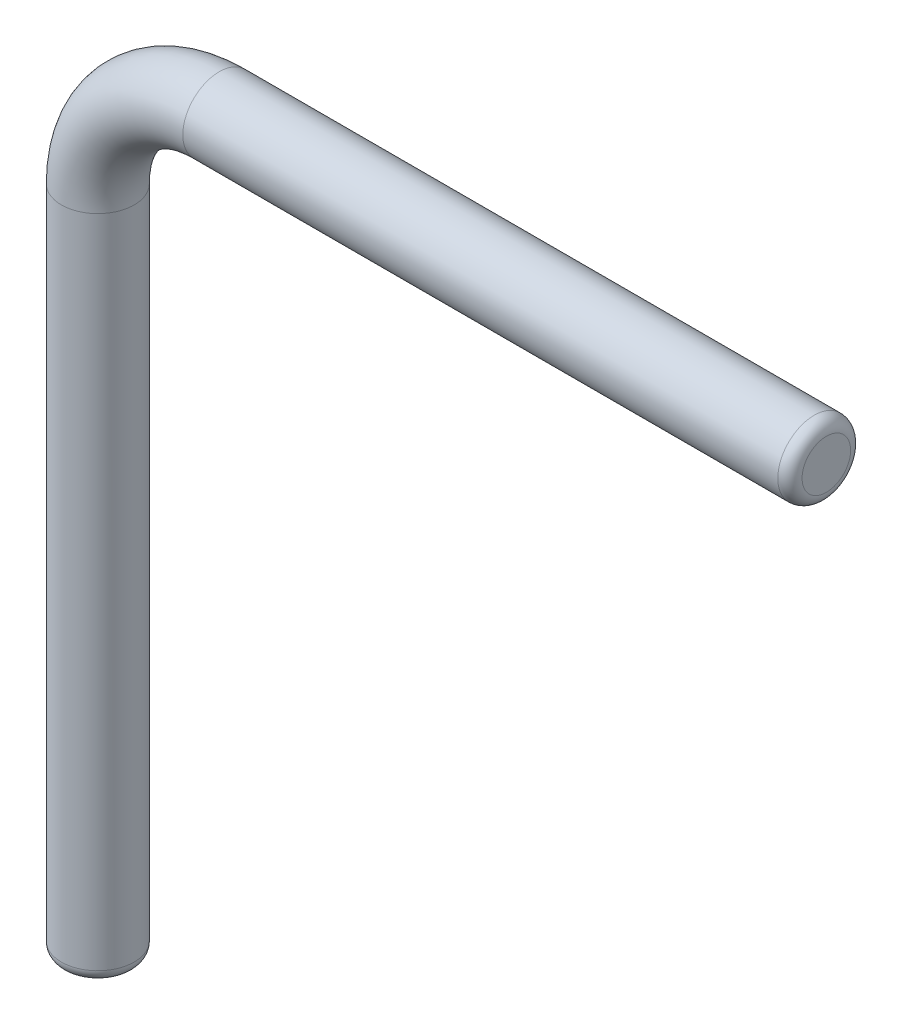
ISO-10303-21;
HEADER;
FILE_DESCRIPTION(('STEP AP214'),'2;1');
FILE_NAME('part.step','',(''),(''),'','','');
FILE_SCHEMA(('AUTOMOTIVE_DESIGN { 1 0 10303 214 1 1 1 1 }'));
ENDSEC;
DATA;
#1=APPLICATION_CONTEXT('core data for automotive mechanical design processes');
#2=APPLICATION_PROTOCOL_DEFINITION('international standard','automotive_design',2000,#1);
#3=PRODUCT_CONTEXT('',#1,'mechanical');
#4=PRODUCT('Part','Part','',(#3));
#5=PRODUCT_RELATED_PRODUCT_CATEGORY('part','',(#4));
#6=PRODUCT_DEFINITION_FORMATION('','',#4);
#7=PRODUCT_DEFINITION_CONTEXT('part definition',#1,'design');
#8=PRODUCT_DEFINITION('design','',#6,#7);
#9=PRODUCT_DEFINITION_SHAPE('','',#8);
#10=(LENGTH_UNIT() NAMED_UNIT(*) SI_UNIT(.MILLI.,.METRE.));
#11=(NAMED_UNIT(*) PLANE_ANGLE_UNIT() SI_UNIT($,.RADIAN.));
#12=(NAMED_UNIT(*) SI_UNIT($,.STERADIAN.) SOLID_ANGLE_UNIT());
#13=UNCERTAINTY_MEASURE_WITH_UNIT(LENGTH_MEASURE(1.E-05),#10,'distance_accuracy_value','');
#14=(GEOMETRIC_REPRESENTATION_CONTEXT(3) GLOBAL_UNCERTAINTY_ASSIGNED_CONTEXT((#13)) GLOBAL_UNIT_ASSIGNED_CONTEXT((#10,
#11,#12)) REPRESENTATION_CONTEXT('',''));
#15=CARTESIAN_POINT('',(0.,0.,0.));
#16=DIRECTION('',(0.,0.,1.));
#17=DIRECTION('',(1.,0.,0.));
#18=AXIS2_PLACEMENT_3D('',#15,#16,#17);
#19=CARTESIAN_POINT('',(1.,6.5,0.));
#20=DIRECTION('',(1.,0.,0.));
#21=DIRECTION('',(0.,0.,-1.));
#22=AXIS2_PLACEMENT_3D('',#19,#20,#21);
#23=CYLINDRICAL_SURFACE('',#22,0.3);
#24=CARTESIAN_POINT('',(5.9,6.5,0.));
#25=DIRECTION('',(1.,0.,0.));
#26=DIRECTION('',(0.,1.,0.));
#27=AXIS2_PLACEMENT_3D('',#24,#25,#26);
#28=CIRCLE('',#27,0.3);
#29=CARTESIAN_POINT('',(5.9,6.8,0.));
#30=VERTEX_POINT('',#29);
#31=EDGE_CURVE('E42',#30,#30,#28,.F.);
#32=ORIENTED_EDGE('',*,*,#31,.T.);
#33=EDGE_LOOP('',(#32));
#34=FACE_BOUND('',#33,.T.);
#35=CARTESIAN_POINT('',(1.,6.5,0.));
#36=DIRECTION('',(1.,0.,0.));
#37=DIRECTION('',(0.,0.,1.));
#38=AXIS2_PLACEMENT_3D('',#35,#36,#37);
#39=CIRCLE('',#38,0.3);
#40=CARTESIAN_POINT('',(1.,6.8,0.));
#41=VERTEX_POINT('',#40);
#42=EDGE_CURVE('E51',#41,#41,#39,.T.);
#43=ORIENTED_EDGE('',*,*,#42,.T.);
#44=EDGE_LOOP('',(#43));
#45=FACE_BOUND('',#44,.T.);
#46=ADVANCED_FACE('F31',(#34,#45),#23,.T.);
#47=CARTESIAN_POINT('',(1.,5.5,0.));
#48=DIRECTION('',(0.,0.,-1.));
#49=DIRECTION('',(-1.,0.,0.));
#50=AXIS2_PLACEMENT_3D('',#47,#48,#49);
#51=TOROIDAL_SURFACE('',#50,1.,0.3);
#52=CARTESIAN_POINT('',(0.,5.5,0.));
#53=DIRECTION('',(0.,1.,0.));
#54=DIRECTION('',(0.,0.,1.));
#55=AXIS2_PLACEMENT_3D('',#52,#53,#54);
#56=CIRCLE('',#55,0.3);
#57=CARTESIAN_POINT('',(-0.3,5.5,0.));
#58=VERTEX_POINT('',#57);
#59=EDGE_CURVE('E54',#58,#58,#56,.T.);
#60=CARTESIAN_POINT('',(1.,5.5,0.));
#61=DIRECTION('',(0.,0.,-1.));
#62=DIRECTION('',(-1.,0.,0.));
#63=AXIS2_PLACEMENT_3D('',#60,#61,#62);
#64=CIRCLE('',#63,1.3);
#65=EDGE_CURVE('',#58,#41,#64,.T.);
#66=ORIENTED_EDGE('',*,*,#59,.T.);
#67=ORIENTED_EDGE('',*,*,#42,.F.);
#68=ORIENTED_EDGE('',*,*,#65,.T.);
#69=ORIENTED_EDGE('',*,*,#65,.F.);
#70=EDGE_LOOP('',(#66,#68,#67,#69));
#71=FACE_BOUND('',#70,.T.);
#72=ADVANCED_FACE('F58',(#71),#51,.T.);
#73=CARTESIAN_POINT('',(0.,5.5,0.));
#74=DIRECTION('',(0.,-1.,0.));
#75=DIRECTION('',(0.,0.,-1.));
#76=AXIS2_PLACEMENT_3D('',#73,#74,#75);
#77=CYLINDRICAL_SURFACE('',#76,0.3);
#78=CARTESIAN_POINT('',(0.,0.1,0.));
#79=DIRECTION('',(0.,1.,0.));
#80=DIRECTION('',(0.,0.,1.));
#81=AXIS2_PLACEMENT_3D('',#78,#79,#80);
#82=CIRCLE('',#81,0.3);
#83=CARTESIAN_POINT('',(0.,0.1,0.3));
#84=VERTEX_POINT('',#83);
#85=EDGE_CURVE('E38',#84,#84,#82,.T.);
#86=ORIENTED_EDGE('',*,*,#85,.T.);
#87=EDGE_LOOP('',(#86));
#88=FACE_BOUND('',#87,.T.);
#89=ORIENTED_EDGE('',*,*,#59,.F.);
#90=EDGE_LOOP('',(#89));
#91=FACE_BOUND('',#90,.T.);
#92=ADVANCED_FACE('F61',(#88,#91),#77,.T.);
#93=CARTESIAN_POINT('',(6.,6.5,0.));
#94=DIRECTION('',(1.,0.,0.));
#95=DIRECTION('',(0.,0.,1.));
#96=AXIS2_PLACEMENT_3D('',#93,#94,#95);
#97=PLANE('',#96);
#98=CARTESIAN_POINT('',(6.,6.5,0.));
#99=DIRECTION('',(1.,0.,0.));
#100=DIRECTION('',(0.,1.,0.));
#101=AXIS2_PLACEMENT_3D('',#98,#99,#100);
#102=CIRCLE('',#101,0.2);
#103=CARTESIAN_POINT('',(6.,6.7,0.));
#104=VERTEX_POINT('',#103);
#105=EDGE_CURVE('E46',#104,#104,#102,.T.);
#106=ORIENTED_EDGE('',*,*,#105,.T.);
#107=EDGE_LOOP('',(#106));
#108=FACE_BOUND('',#107,.T.);
#109=ADVANCED_FACE('F63',(#108),#97,.T.);
#110=CARTESIAN_POINT('',(0.,0.,0.));
#111=DIRECTION('',(0.,1.,0.));
#112=DIRECTION('',(0.,0.,1.));
#113=AXIS2_PLACEMENT_3D('',#110,#111,#112);
#114=PLANE('',#113);
#115=CARTESIAN_POINT('',(0.,0.,0.));
#116=DIRECTION('',(0.,1.,0.));
#117=DIRECTION('',(0.,0.,1.));
#118=AXIS2_PLACEMENT_3D('',#115,#116,#117);
#119=CIRCLE('',#118,0.2);
#120=CARTESIAN_POINT('',(0.,0.,0.2));
#121=VERTEX_POINT('',#120);
#122=EDGE_CURVE('E10',#121,#121,#119,.F.);
#123=ORIENTED_EDGE('',*,*,#122,.T.);
#124=EDGE_LOOP('',(#123));
#125=FACE_BOUND('',#124,.T.);
#126=ADVANCED_FACE('F69',(#125),#114,.F.);
#127=CARTESIAN_POINT('',(5.9,6.5,0.));
#128=DIRECTION('',(1.,0.,0.));
#129=DIRECTION('',(0.,1.,0.));
#130=AXIS2_PLACEMENT_3D('',#127,#128,#129);
#131=TOROIDAL_SURFACE('',#130,0.2,0.1);
#132=ORIENTED_EDGE('',*,*,#31,.F.);
#133=EDGE_LOOP('',(#132));
#134=FACE_BOUND('',#133,.T.);
#135=ORIENTED_EDGE('',*,*,#105,.F.);
#136=EDGE_LOOP('',(#135));
#137=FACE_BOUND('',#136,.T.);
#138=ADVANCED_FACE('F80',(#134,#137),#131,.T.);
#139=CARTESIAN_POINT('',(0.,0.1,0.));
#140=DIRECTION('',(0.,1.,0.));
#141=DIRECTION('',(0.,0.,1.));
#142=AXIS2_PLACEMENT_3D('',#139,#140,#141);
#143=TOROIDAL_SURFACE('',#142,0.2,0.1);
#144=ORIENTED_EDGE('',*,*,#122,.F.);
#145=EDGE_LOOP('',(#144));
#146=FACE_BOUND('',#145,.T.);
#147=ORIENTED_EDGE('',*,*,#85,.F.);
#148=EDGE_LOOP('',(#147));
#149=FACE_BOUND('',#148,.T.);
#150=ADVANCED_FACE('F33',(#146,#149),#143,.T.);
#151=CLOSED_SHELL('',(#46,#72,#92,#109,#126,#138,#150));
#152=MANIFOLD_SOLID_BREP('B2',#151);
#153=ADVANCED_BREP_SHAPE_REPRESENTATION('',(#18,#152),#14);
#154=SHAPE_DEFINITION_REPRESENTATION(#9,#153);
ENDSEC;
END-ISO-10303-21;
